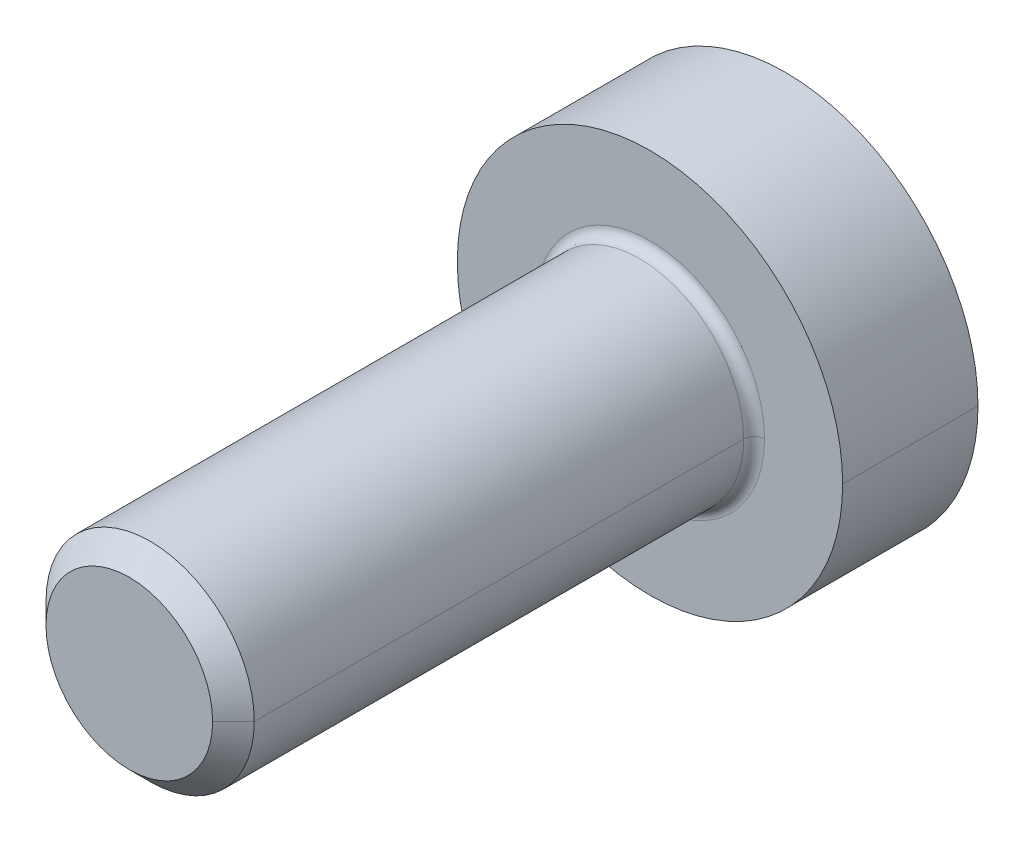
ISO-10303-21;
HEADER;
FILE_DESCRIPTION(('STEP AP214'),'2;1');
FILE_NAME('part.step','',(''),(''),'','','');
FILE_SCHEMA(('AUTOMOTIVE_DESIGN { 1 0 10303 214 1 1 1 1 }'));
ENDSEC;
DATA;
#1=APPLICATION_CONTEXT('core data for automotive mechanical design processes');
#2=APPLICATION_PROTOCOL_DEFINITION('international standard','automotive_design',2000,#1);
#3=PRODUCT_CONTEXT('',#1,'mechanical');
#4=PRODUCT('Part','Part','',(#3));
#5=PRODUCT_RELATED_PRODUCT_CATEGORY('part','',(#4));
#6=PRODUCT_DEFINITION_FORMATION('','',#4);
#7=PRODUCT_DEFINITION_CONTEXT('part definition',#1,'design');
#8=PRODUCT_DEFINITION('design','',#6,#7);
#9=PRODUCT_DEFINITION_SHAPE('','',#8);
#10=(LENGTH_UNIT() NAMED_UNIT(*) SI_UNIT(.MILLI.,.METRE.));
#11=(NAMED_UNIT(*) PLANE_ANGLE_UNIT() SI_UNIT($,.RADIAN.));
#12=(NAMED_UNIT(*) SI_UNIT($,.STERADIAN.) SOLID_ANGLE_UNIT());
#13=UNCERTAINTY_MEASURE_WITH_UNIT(LENGTH_MEASURE(1.E-05),#10,'distance_accuracy_value','');
#14=(GEOMETRIC_REPRESENTATION_CONTEXT(3) GLOBAL_UNCERTAINTY_ASSIGNED_CONTEXT((#13)) GLOBAL_UNIT_ASSIGNED_CONTEXT((#10,
#11,#12)) REPRESENTATION_CONTEXT('',''));
#15=CARTESIAN_POINT('',(0.,0.,0.));
#16=DIRECTION('',(0.,0.,1.));
#17=DIRECTION('',(1.,0.,0.));
#18=AXIS2_PLACEMENT_3D('',#15,#16,#17);
#19=CARTESIAN_POINT('',(0.,0.,6.3));
#20=DIRECTION('',(0.,0.,1.));
#21=DIRECTION('',(1.,0.,0.));
#22=AXIS2_PLACEMENT_3D('',#19,#20,#21);
#23=CYLINDRICAL_SURFACE('',#22,0.8);
#24=CARTESIAN_POINT('',(0.8,0.,1.3));
#25=DIRECTION('',(0.,0.,1.));
#26=VECTOR('',#25,1.);
#27=LINE('',#24,#26);
#28=CARTESIAN_POINT('',(0.8,0.,1.3));
#29=VERTEX_POINT('',#28);
#30=CARTESIAN_POINT('',(0.8,0.,6.3));
#31=VERTEX_POINT('',#30);
#32=EDGE_CURVE('P0_E27',#29,#31,#27,.T.);
#33=ORIENTED_EDGE('',*,*,#32,.T.);
#34=CARTESIAN_POINT('',(0.,0.,6.3));
#35=DIRECTION('',(0.,0.,-1.));
#36=DIRECTION('',(1.,0.,0.));
#37=AXIS2_PLACEMENT_3D('',#34,#35,#36);
#38=CIRCLE('',#37,0.8);
#39=CARTESIAN_POINT('',(-0.8,0.,6.3));
#40=VERTEX_POINT('',#39);
#41=EDGE_CURVE('P0_E11',#31,#40,#38,.T.);
#42=ORIENTED_EDGE('',*,*,#41,.T.);
#43=CARTESIAN_POINT('',(-0.8,0.,6.3));
#44=DIRECTION('',(0.,0.,-1.));
#45=VECTOR('',#44,1.);
#46=LINE('',#43,#45);
#47=CARTESIAN_POINT('',(-0.8,0.,1.3));
#48=VERTEX_POINT('',#47);
#49=EDGE_CURVE('P0_E94',#40,#48,#46,.T.);
#50=ORIENTED_EDGE('',*,*,#49,.T.);
#51=CARTESIAN_POINT('',(0.,0.,1.3));
#52=DIRECTION('',(0.,0.,1.));
#53=DIRECTION('',(-1.,0.,0.));
#54=AXIS2_PLACEMENT_3D('',#51,#52,#53);
#55=CIRCLE('',#54,0.8);
#56=EDGE_CURVE('P0_E73',#48,#29,#55,.T.);
#57=ORIENTED_EDGE('',*,*,#56,.T.);
#58=EDGE_LOOP('',(#33,#42,#50,#57));
#59=FACE_BOUND('',#58,.T.);
#60=ADVANCED_FACE('P0_F16',(#59),#23,.T.);
#61=CARTESIAN_POINT('',(0.,0.,6.3));
#62=DIRECTION('',(0.,0.,1.));
#63=DIRECTION('',(1.,0.,0.));
#64=AXIS2_PLACEMENT_3D('',#61,#62,#63);
#65=CYLINDRICAL_SURFACE('',#64,0.8);
#66=ORIENTED_EDGE('',*,*,#49,.F.);
#67=CARTESIAN_POINT('',(0.,0.,6.3));
#68=DIRECTION('',(0.,0.,-1.));
#69=DIRECTION('',(-1.,0.,0.));
#70=AXIS2_PLACEMENT_3D('',#67,#68,#69);
#71=CIRCLE('',#70,0.8);
#72=EDGE_CURVE('P0_E35',#40,#31,#71,.T.);
#73=ORIENTED_EDGE('',*,*,#72,.T.);
#74=ORIENTED_EDGE('',*,*,#32,.F.);
#75=CARTESIAN_POINT('',(0.,0.,1.3));
#76=DIRECTION('',(0.,0.,1.));
#77=DIRECTION('',(1.,0.,0.));
#78=AXIS2_PLACEMENT_3D('',#75,#76,#77);
#79=CIRCLE('',#78,0.8);
#80=EDGE_CURVE('P0_E56',#29,#48,#79,.T.);
#81=ORIENTED_EDGE('',*,*,#80,.T.);
#82=EDGE_LOOP('',(#66,#73,#74,#81));
#83=FACE_BOUND('',#82,.T.);
#84=ADVANCED_FACE('P0_F86',(#83),#65,.T.);
#85=CARTESIAN_POINT('',(0.,0.,1.3));
#86=DIRECTION('',(0.,0.,1.));
#87=DIRECTION('',(1.,0.,0.));
#88=AXIS2_PLACEMENT_3D('',#85,#86,#87);
#89=PLANE('',#88);
#90=ORIENTED_EDGE('',*,*,#56,.F.);
#91=ORIENTED_EDGE('',*,*,#80,.F.);
#92=EDGE_LOOP('',(#90,#91));
#93=FACE_BOUND('',#92,.T.);
#94=CARTESIAN_POINT('',(-1.,0.,1.3));
#95=CARTESIAN_POINT('',(-0.996554083441114,-0.209703851577792,1.3));
#96=CARTESIAN_POINT('',(-0.922226760783708,-0.386631412951767,1.3));
#97=CARTESIAN_POINT('',(-0.845262108690317,-0.569836830825425,1.3));
#98=CARTESIAN_POINT('',(-0.702627907972833,-0.711532071929233,1.3));
#99=CARTESIAN_POINT('',(-0.562888071399035,-0.850352002461534,1.3));
#100=CARTESIAN_POINT('',(-0.378430108277403,-0.92560272814395,1.3));
#101=CARTESIAN_POINT('',(-0.194337694161928,-1.00070432593012,1.3));
#102=CARTESIAN_POINT('',(0.00390955983632408,-0.999965197467083,1.3));
#103=CARTESIAN_POINT('',(0.201416048891478,-0.999228830810036,1.3));
#104=CARTESIAN_POINT('',(0.385937188211464,-0.92250020220585,1.3));
#105=CARTESIAN_POINT('',(0.567592859321982,-0.846963108874163,1.3));
#106=CARTESIAN_POINT('',(0.706969694859683,-0.707222004365567,1.3));
#107=CARTESIAN_POINT('',(0.846929856822322,-0.566896048876567,1.3));
#108=CARTESIAN_POINT('',(0.923036338619758,-0.384696891490225,1.3));
#109=CARTESIAN_POINT('',(0.996267348491069,-0.209381622961374,1.3));
#110=CARTESIAN_POINT('',(1.,0.,1.3));
#111=B_SPLINE_CURVE_WITH_KNOTS('',2,(#94,#95,#96,#97,#98,#99,#100,#101,#102,#103,#104,#105,#106,
#107,#108,#109,#110),.UNSPECIFIED.,.F.,.F.,(3,2,2,2,2,2,2,2,3),(0.,0.125,0.25,0.375,0.5,0.625,
0.75,0.875,1.),.UNSPECIFIED.);
#112=CARTESIAN_POINT('',(-1.,0.,1.3));
#113=VERTEX_POINT('',#112);
#114=CARTESIAN_POINT('',(1.,0.,1.3));
#115=VERTEX_POINT('',#114);
#116=EDGE_CURVE('P0_E49',#113,#115,#111,.T.);
#117=ORIENTED_EDGE('',*,*,#116,.T.);
#118=CARTESIAN_POINT('',(1.,0.,1.3));
#119=CARTESIAN_POINT('',(0.996554083441114,0.209703851577792,1.3));
#120=CARTESIAN_POINT('',(0.922226760783708,0.386631412951767,1.3));
#121=CARTESIAN_POINT('',(0.845262108690317,0.569836830825425,1.3));
#122=CARTESIAN_POINT('',(0.702627907972833,0.711532071929233,1.3));
#123=CARTESIAN_POINT('',(0.562888071399035,0.850352002461534,1.3));
#124=CARTESIAN_POINT('',(0.378430108277403,0.92560272814395,1.3));
#125=CARTESIAN_POINT('',(0.194337694161928,1.00070432593012,1.3));
#126=CARTESIAN_POINT('',(-0.00390955983632408,0.999965197467083,1.3));
#127=CARTESIAN_POINT('',(-0.201416048891478,0.999228830810036,1.3));
#128=CARTESIAN_POINT('',(-0.385937188211464,0.92250020220585,1.3));
#129=CARTESIAN_POINT('',(-0.567592859321982,0.846963108874163,1.3));
#130=CARTESIAN_POINT('',(-0.706969694859683,0.707222004365567,1.3));
#131=CARTESIAN_POINT('',(-0.846929856822322,0.566896048876567,1.3));
#132=CARTESIAN_POINT('',(-0.923036338619758,0.384696891490225,1.3));
#133=CARTESIAN_POINT('',(-0.996267348491069,0.209381622961374,1.3));
#134=CARTESIAN_POINT('',(-1.,0.,1.3));
#135=B_SPLINE_CURVE_WITH_KNOTS('',2,(#118,#119,#120,#121,#122,#123,#124,#125,#126,#127,#128,
#129,#130,#131,#132,#133,#134),.UNSPECIFIED.,.F.,.F.,(3,2,2,2,2,2,2,2,3),(0.,0.125,0.25,0.375,
0.5,0.625,0.75,0.875,1.),.UNSPECIFIED.);
#136=EDGE_CURVE('P0_E53',#115,#113,#135,.T.);
#137=ORIENTED_EDGE('',*,*,#136,.T.);
#138=EDGE_LOOP('',(#117,#137));
#139=FACE_BOUND('',#138,.T.);
#140=ADVANCED_FACE('P0_F17',(#93,#139),#89,.T.);
#141=OPEN_SHELL('',(#60,#84,#140));
#142=SHELL_BASED_SURFACE_MODEL('P0_B1',(#141));
#143=CARTESIAN_POINT('',(0.,0.,6.3));
#144=DIRECTION('',(0.,0.,1.));
#145=DIRECTION('',(1.,0.,0.));
#146=AXIS2_PLACEMENT_3D('',#143,#144,#145);
#147=PLANE('',#146);
#148=CARTESIAN_POINT('',(0.,0.,6.3));
#149=DIRECTION('',(0.,0.,-1.));
#150=DIRECTION('',(0.,-1.,0.));
#151=AXIS2_PLACEMENT_3D('',#148,#149,#150);
#152=CIRCLE('',#151,0.8000000000001);
#153=CARTESIAN_POINT('',(0.,-0.8000000000001,6.3));
#154=VERTEX_POINT('',#153);
#155=CARTESIAN_POINT('',(-0.8000000000001,0.,6.3));
#156=VERTEX_POINT('',#155);
#157=EDGE_CURVE('P1_E11',#154,#156,#152,.T.);
#158=ORIENTED_EDGE('',*,*,#157,.F.);
#159=CARTESIAN_POINT('',(0.,0.,6.3));
#160=DIRECTION('',(0.,0.,-1.));
#161=DIRECTION('',(1.,0.,0.));
#162=AXIS2_PLACEMENT_3D('',#159,#160,#161);
#163=CIRCLE('',#162,0.8000000000001);
#164=CARTESIAN_POINT('',(0.8000000000001,-1.782773509101E-08,6.3));
#165=VERTEX_POINT('',#164);
#166=EDGE_CURVE('P1_E27',#165,#154,#163,.T.);
#167=ORIENTED_EDGE('',*,*,#166,.F.);
#168=CARTESIAN_POINT('',(0.,0.,6.3));
#169=DIRECTION('',(0.,0.,-1.));
#170=DIRECTION('',(0.,1.,0.));
#171=AXIS2_PLACEMENT_3D('',#168,#169,#170);
#172=CIRCLE('',#171,0.8000000000001);
#173=CARTESIAN_POINT('',(0.,0.8000000000001,6.3));
#174=VERTEX_POINT('',#173);
#175=EDGE_CURVE('P1_E159',#174,#165,#172,.T.);
#176=ORIENTED_EDGE('',*,*,#175,.F.);
#177=CARTESIAN_POINT('',(0.,0.,6.3));
#178=DIRECTION('',(0.,0.,-1.));
#179=DIRECTION('',(-1.,0.,0.));
#180=AXIS2_PLACEMENT_3D('',#177,#178,#179);
#181=CIRCLE('',#180,0.8000000000001);
#182=EDGE_CURVE('P1_E218',#156,#174,#181,.T.);
#183=ORIENTED_EDGE('',*,*,#182,.F.);
#184=EDGE_LOOP('',(#158,#167,#176,#183));
#185=FACE_BOUND('',#184,.T.);
#186=ADVANCED_FACE('P1_F16',(#185),#147,.T.);
#187=CARTESIAN_POINT('',(0.,0.,6.2));
#188=DIRECTION('',(0.,0.,-1.));
#189=DIRECTION('',(0.,-1.,0.));
#190=AXIS2_PLACEMENT_3D('',#187,#188,#189);
#191=CONICAL_SURFACE('',#190,0.9000000000001,0.7853981633973);
#192=DIRECTION('',(0.707106781186498,-2.22582120003299E-08,-0.707106781186597));
#193=VECTOR('',#192,1.);
#194=CARTESIAN_POINT('',(0.8000000000001,-1.782773509101E-08,6.3));
#195=LINE('',#194,#193);
#196=CARTESIAN_POINT('',(1.,-1.481961296978E-08,6.1));
#197=VERTEX_POINT('',#196);
#198=EDGE_CURVE('P1_E151',#165,#197,#195,.T.);
#199=ORIENTED_EDGE('',*,*,#198,.F.);
#200=ORIENTED_EDGE('',*,*,#166,.T.);
#201=ORIENTED_EDGE('',*,*,#157,.T.);
#202=DIRECTION('',(-0.707106781186498,-3.93941033222099E-09,-0.707106781186598));
#203=VECTOR('',#202,1.);
#204=CARTESIAN_POINT('',(-0.8000000000001,1.782773532786E-08,6.3));
#205=LINE('',#204,#203);
#206=CARTESIAN_POINT('',(-1.,1.671350182394E-08,6.1));
#207=VERTEX_POINT('',#206);
#208=EDGE_CURVE('P1_E172',#156,#207,#205,.T.);
#209=ORIENTED_EDGE('',*,*,#208,.T.);
#210=CARTESIAN_POINT('',(0.,0.,6.1));
#211=DIRECTION('',(0.,0.,-1.));
#212=DIRECTION('',(0.,-1.,0.));
#213=AXIS2_PLACEMENT_3D('',#210,#211,#212);
#214=CIRCLE('',#213,1.);
#215=CARTESIAN_POINT('',(0.,-1.,6.1));
#216=VERTEX_POINT('',#215);
#217=EDGE_CURVE('P1_E177',#216,#207,#214,.T.);
#218=ORIENTED_EDGE('',*,*,#217,.F.);
#219=CARTESIAN_POINT('',(0.,0.,6.1));
#220=DIRECTION('',(0.,0.,-1.));
#221=DIRECTION('',(1.,-1.481961296978E-08,0.));
#222=AXIS2_PLACEMENT_3D('',#219,#220,#221);
#223=CIRCLE('',#222,1.);
#224=EDGE_CURVE('P1_E175',#197,#216,#223,.T.);
#225=ORIENTED_EDGE('',*,*,#224,.F.);
#226=EDGE_LOOP('',(#199,#200,#201,#209,#218,#225));
#227=FACE_BOUND('',#226,.T.);
#228=ADVANCED_FACE('P1_F18',(#227),#191,.T.);
#229=CARTESIAN_POINT('',(0.,0.,6.2));
#230=DIRECTION('',(0.,0.,-1.));
#231=DIRECTION('',(0.,-1.,0.));
#232=AXIS2_PLACEMENT_3D('',#229,#230,#231);
#233=CONICAL_SURFACE('',#232,0.9000000000001,0.7853981633973);
#234=ORIENTED_EDGE('',*,*,#208,.F.);
#235=ORIENTED_EDGE('',*,*,#182,.T.);
#236=ORIENTED_EDGE('',*,*,#175,.T.);
#237=ORIENTED_EDGE('',*,*,#198,.T.);
#238=CARTESIAN_POINT('',(0.,0.,6.1));
#239=DIRECTION('',(0.,0.,-1.));
#240=DIRECTION('',(0.,1.,0.));
#241=AXIS2_PLACEMENT_3D('',#238,#239,#240);
#242=CIRCLE('',#241,1.);
#243=CARTESIAN_POINT('',(0.,1.,6.1));
#244=VERTEX_POINT('',#243);
#245=EDGE_CURVE('P1_E156',#244,#197,#242,.T.);
#246=ORIENTED_EDGE('',*,*,#245,.F.);
#247=CARTESIAN_POINT('',(0.,0.,6.1));
#248=DIRECTION('',(0.,0.,-1.));
#249=DIRECTION('',(-1.,0.,0.));
#250=AXIS2_PLACEMENT_3D('',#247,#248,#249);
#251=CIRCLE('',#250,1.);
#252=EDGE_CURVE('P1_E170',#207,#244,#251,.T.);
#253=ORIENTED_EDGE('',*,*,#252,.F.);
#254=EDGE_LOOP('',(#234,#235,#236,#237,#246,#253));
#255=FACE_BOUND('',#254,.T.);
#256=ADVANCED_FACE('P1_F154',(#255),#233,.T.);
#257=CARTESIAN_POINT('',(0.,0.,15.5));
#258=DIRECTION('',(0.,0.,-1.));
#259=DIRECTION('',(-1.,0.,0.));
#260=AXIS2_PLACEMENT_3D('',#257,#258,#259);
#261=CYLINDRICAL_SURFACE('',#260,1.);
#262=DIRECTION('',(0.,3.54836305446E-09,1.));
#263=VECTOR('',#262,1.);
#264=CARTESIAN_POINT('',(-1.,3.619546798041E-11,1.4));
#265=LINE('',#264,#263);
#266=CARTESIAN_POINT('',(-1.,0.,1.4));
#267=VERTEX_POINT('',#266);
#268=EDGE_CURVE('P1_E240',#267,#207,#265,.T.);
#269=ORIENTED_EDGE('',*,*,#268,.T.);
#270=ORIENTED_EDGE('',*,*,#252,.T.);
#271=ORIENTED_EDGE('',*,*,#245,.T.);
#272=DIRECTION('',(0.,3.548363007216E-09,-1.));
#273=VECTOR('',#272,1.);
#274=CARTESIAN_POINT('',(1.,-2.412330814802E-08,6.1));
#275=LINE('',#274,#273);
#276=CARTESIAN_POINT('',(1.,-1.481961296734E-08,1.4));
#277=VERTEX_POINT('',#276);
#278=EDGE_CURVE('P1_E169',#197,#277,#275,.T.);
#279=ORIENTED_EDGE('',*,*,#278,.T.);
#280=CARTESIAN_POINT('',(0.,0.,1.4));
#281=DIRECTION('',(0.,0.,1.));
#282=DIRECTION('',(1.,-1.481961296978E-08,0.));
#283=AXIS2_PLACEMENT_3D('',#280,#281,#282);
#284=CIRCLE('',#283,1.);
#285=CARTESIAN_POINT('',(-0.9940416406652,0.1090009936818,1.4));
#286=VERTEX_POINT('',#285);
#287=EDGE_CURVE('P1_E236',#277,#286,#284,.T.);
#288=ORIENTED_EDGE('',*,*,#287,.T.);
#289=CARTESIAN_POINT('',(0.,0.,1.4));
#290=DIRECTION('',(0.,0.,1.));
#291=DIRECTION('',(-0.994041640665209,0.109000993681801,0.));
#292=AXIS2_PLACEMENT_3D('',#289,#290,#291);
#293=CIRCLE('',#292,1.);
#294=EDGE_CURVE('P1_E239',#286,#267,#293,.T.);
#295=ORIENTED_EDGE('',*,*,#294,.T.);
#296=EDGE_LOOP('',(#269,#270,#271,#279,#288,#295));
#297=FACE_BOUND('',#296,.T.);
#298=ADVANCED_FACE('P1_F167',(#297),#261,.T.);
#299=CARTESIAN_POINT('',(0.,0.,1.4));
#300=DIRECTION('',(0.,0.,-1.));
#301=DIRECTION('',(0.994041640665209,-0.109000993681801,0.));
#302=AXIS2_PLACEMENT_3D('',#299,#300,#301);
#303=TOROIDAL_SURFACE('',#302,1.1,0.1);
#304=CARTESIAN_POINT('',(-1.1,7.963049664106E-11,1.4));
#305=DIRECTION('',(7.239134292014E-11,1.,0.));
#306=DIRECTION('',(1.,-7.239134292014E-11,0.));
#307=AXIS2_PLACEMENT_3D('',#304,#305,#306);
#308=CIRCLE('',#307,0.1);
#309=CARTESIAN_POINT('',(-1.1,0.,1.3));
#310=VERTEX_POINT('',#309);
#311=EDGE_CURVE('P1_E261',#267,#310,#308,.T.);
#312=ORIENTED_EDGE('',*,*,#311,.F.);
#313=ORIENTED_EDGE('',*,*,#294,.F.);
#314=ORIENTED_EDGE('',*,*,#287,.F.);
#315=CARTESIAN_POINT('',(1.1,-7.963049664106E-11,1.4));
#316=DIRECTION('',(-7.239134292014E-11,-1.,0.));
#317=DIRECTION('',(-1.,7.239134292014E-11,0.));
#318=AXIS2_PLACEMENT_3D('',#315,#316,#317);
#319=CIRCLE('',#318,0.1);
#320=CARTESIAN_POINT('',(1.1,0.,1.3));
#321=VERTEX_POINT('',#320);
#322=EDGE_CURVE('P1_E194',#277,#321,#319,.T.);
#323=ORIENTED_EDGE('',*,*,#322,.T.);
#324=CARTESIAN_POINT('',(0.,0.,1.3));
#325=DIRECTION('',(0.,0.,1.));
#326=DIRECTION('',(1.,0.,0.));
#327=AXIS2_PLACEMENT_3D('',#324,#325,#326);
#328=CIRCLE('',#327,1.1);
#329=EDGE_CURVE('P1_E244',#321,#310,#328,.T.);
#330=ORIENTED_EDGE('',*,*,#329,.T.);
#331=EDGE_LOOP('',(#312,#313,#314,#323,#330));
#332=FACE_BOUND('',#331,.T.);
#333=ADVANCED_FACE('P1_F365',(#332),#303,.F.);
#334=CARTESIAN_POINT('',(0.,0.,0.8));
#335=DIRECTION('',(0.,0.,-1.));
#336=DIRECTION('',(0.,-1.,0.));
#337=AXIS2_PLACEMENT_3D('',#334,#335,#336);
#338=PLANE('',#337);
#339=DIRECTION('',(0.,1.,0.));
#340=VECTOR('',#339,1.);
#341=CARTESIAN_POINT('',(0.75,-0.4330127018922,0.8));
#342=LINE('',#341,#340);
#343=CARTESIAN_POINT('',(0.75,-0.4330127018922,0.8));
#344=VERTEX_POINT('',#343);
#345=CARTESIAN_POINT('',(0.75,0.4330127018922,0.8));
#346=VERTEX_POINT('',#345);
#347=EDGE_CURVE('P1_E250',#344,#346,#342,.T.);
#348=ORIENTED_EDGE('',*,*,#347,.F.);
#349=DIRECTION('',(0.866025403784429,0.500000000000017,0.));
#350=VECTOR('',#349,1.);
#351=CARTESIAN_POINT('',(0.,-0.8660254037844,0.8));
#352=LINE('',#351,#350);
#353=CARTESIAN_POINT('',(0.,-0.8660254037844,0.8));
#354=VERTEX_POINT('',#353);
#355=EDGE_CURVE('P1_E228',#354,#344,#352,.T.);
#356=ORIENTED_EDGE('',*,*,#355,.F.);
#357=DIRECTION('',(0.866025403784429,-0.500000000000017,0.));
#358=VECTOR('',#357,1.);
#359=CARTESIAN_POINT('',(-0.75,-0.4330127018922,0.8));
#360=LINE('',#359,#358);
#361=CARTESIAN_POINT('',(-0.75,-0.4330127018922,0.8));
#362=VERTEX_POINT('',#361);
#363=EDGE_CURVE('P1_E229',#362,#354,#360,.T.);
#364=ORIENTED_EDGE('',*,*,#363,.F.);
#365=DIRECTION('',(0.,-1.,0.));
#366=VECTOR('',#365,1.);
#367=CARTESIAN_POINT('',(-0.75,0.4330127018922,0.8));
#368=LINE('',#367,#366);
#369=CARTESIAN_POINT('',(-0.75,0.4330127018922,0.8));
#370=VERTEX_POINT('',#369);
#371=EDGE_CURVE('P1_E207',#370,#362,#368,.T.);
#372=ORIENTED_EDGE('',*,*,#371,.F.);
#373=DIRECTION('',(-0.866025403784429,-0.500000000000017,0.));
#374=VECTOR('',#373,1.);
#375=CARTESIAN_POINT('',(0.,0.8660254037844,0.8));
#376=LINE('',#375,#374);
#377=CARTESIAN_POINT('',(0.,0.8660254037844,0.8));
#378=VERTEX_POINT('',#377);
#379=EDGE_CURVE('P1_E20',#378,#370,#376,.T.);
#380=ORIENTED_EDGE('',*,*,#379,.F.);
#381=DIRECTION('',(-0.866025403784429,0.500000000000017,0.));
#382=VECTOR('',#381,1.);
#383=CARTESIAN_POINT('',(0.75,0.4330127018922,0.8));
#384=LINE('',#383,#382);
#385=EDGE_CURVE('P1_E223',#346,#378,#384,.T.);
#386=ORIENTED_EDGE('',*,*,#385,.F.);
#387=EDGE_LOOP('',(#348,#356,#364,#372,#380,#386));
#388=FACE_BOUND('',#387,.T.);
#389=ADVANCED_FACE('P1_F368',(#388),#338,.T.);
#390=CARTESIAN_POINT('',(0.75,0.4330127018922,0.));
#391=DIRECTION('',(1.,0.,0.));
#392=DIRECTION('',(0.,1.,0.));
#393=AXIS2_PLACEMENT_3D('',#390,#391,#392);
#394=PLANE('',#393);
#395=DIRECTION('',(0.,0.,-1.));
#396=VECTOR('',#395,1.);
#397=CARTESIAN_POINT('',(0.75,-0.4330127018922,0.8));
#398=LINE('',#397,#396);
#399=CARTESIAN_POINT('',(0.75,-0.4330127018922,0.));
#400=VERTEX_POINT('',#399);
#401=EDGE_CURVE('P1_E251',#344,#400,#398,.T.);
#402=ORIENTED_EDGE('',*,*,#401,.F.);
#403=ORIENTED_EDGE('',*,*,#347,.T.);
#404=DIRECTION('',(0.,0.,-1.));
#405=VECTOR('',#404,1.);
#406=CARTESIAN_POINT('',(0.75,0.4330127018922,0.8));
#407=LINE('',#406,#405);
#408=CARTESIAN_POINT('',(0.75,0.4330127018922,0.));
#409=VERTEX_POINT('',#408);
#410=EDGE_CURVE('P1_E220',#346,#409,#407,.T.);
#411=ORIENTED_EDGE('',*,*,#410,.T.);
#412=DIRECTION('',(0.,1.,0.));
#413=VECTOR('',#412,1.);
#414=CARTESIAN_POINT('',(0.75,-0.4330127018922,0.));
#415=LINE('',#414,#413);
#416=EDGE_CURVE('P1_E235',#400,#409,#415,.T.);
#417=ORIENTED_EDGE('',*,*,#416,.F.);
#418=EDGE_LOOP('',(#402,#403,#411,#417));
#419=FACE_BOUND('',#418,.T.);
#420=ADVANCED_FACE('P1_F384',(#419),#394,.F.);
#421=CARTESIAN_POINT('',(0.75,-0.4330127018922,0.));
#422=DIRECTION('',(0.500000000000017,-0.866025403784429,0.));
#423=DIRECTION('',(0.,0.,-1.));
#424=AXIS2_PLACEMENT_3D('',#421,#422,#423);
#425=PLANE('',#424);
#426=DIRECTION('',(0.,0.,-1.));
#427=VECTOR('',#426,1.);
#428=CARTESIAN_POINT('',(0.,-0.8660254037844,0.8));
#429=LINE('',#428,#427);
#430=CARTESIAN_POINT('',(0.,-0.8660254037844,0.));
#431=VERTEX_POINT('',#430);
#432=EDGE_CURVE('P1_E225',#354,#431,#429,.T.);
#433=ORIENTED_EDGE('',*,*,#432,.F.);
#434=ORIENTED_EDGE('',*,*,#355,.T.);
#435=ORIENTED_EDGE('',*,*,#401,.T.);
#436=DIRECTION('',(-0.866025403784429,-0.500000000000017,0.));
#437=VECTOR('',#436,1.);
#438=CARTESIAN_POINT('',(0.75,-0.4330127018922,0.));
#439=LINE('',#438,#437);
#440=EDGE_CURVE('P1_E269',#400,#431,#439,.T.);
#441=ORIENTED_EDGE('',*,*,#440,.T.);
#442=EDGE_LOOP('',(#433,#434,#435,#441));
#443=FACE_BOUND('',#442,.T.);
#444=ADVANCED_FACE('P1_F363',(#443),#425,.F.);
#445=CARTESIAN_POINT('',(0.,-0.8660254037844,0.));
#446=DIRECTION('',(-0.500000000000017,-0.866025403784429,0.));
#447=DIRECTION('',(-0.866025403784429,0.500000000000017,0.));
#448=AXIS2_PLACEMENT_3D('',#445,#446,#447);
#449=PLANE('',#448);
#450=DIRECTION('',(0.,0.,-1.));
#451=VECTOR('',#450,1.);
#452=CARTESIAN_POINT('',(-0.75,-0.4330127018922,0.8));
#453=LINE('',#452,#451);
#454=CARTESIAN_POINT('',(-0.75,-0.4330127018922,0.));
#455=VERTEX_POINT('',#454);
#456=EDGE_CURVE('P1_E211',#362,#455,#453,.T.);
#457=ORIENTED_EDGE('',*,*,#456,.F.);
#458=ORIENTED_EDGE('',*,*,#363,.T.);
#459=ORIENTED_EDGE('',*,*,#432,.T.);
#460=DIRECTION('',(-0.866025403784429,0.500000000000017,0.));
#461=VECTOR('',#460,1.);
#462=CARTESIAN_POINT('',(0.,-0.8660254037844,0.));
#463=LINE('',#462,#461);
#464=EDGE_CURVE('P1_E205',#431,#455,#463,.T.);
#465=ORIENTED_EDGE('',*,*,#464,.T.);
#466=EDGE_LOOP('',(#457,#458,#459,#465));
#467=FACE_BOUND('',#466,.T.);
#468=ADVANCED_FACE('P1_F352',(#467),#449,.F.);
#469=CARTESIAN_POINT('',(-0.75,-0.4330127018922,0.));
#470=DIRECTION('',(-1.,0.,0.));
#471=DIRECTION('',(0.,0.,1.));
#472=AXIS2_PLACEMENT_3D('',#469,#470,#471);
#473=PLANE('',#472);
#474=DIRECTION('',(0.,0.,-1.));
#475=VECTOR('',#474,1.);
#476=CARTESIAN_POINT('',(-0.75,0.4330127018922,0.8));
#477=LINE('',#476,#475);
#478=CARTESIAN_POINT('',(-0.75,0.4330127018922,0.));
#479=VERTEX_POINT('',#478);
#480=EDGE_CURVE('P1_E212',#370,#479,#477,.T.);
#481=ORIENTED_EDGE('',*,*,#480,.F.);
#482=ORIENTED_EDGE('',*,*,#371,.T.);
#483=ORIENTED_EDGE('',*,*,#456,.T.);
#484=DIRECTION('',(0.,-1.,0.));
#485=VECTOR('',#484,1.);
#486=CARTESIAN_POINT('',(-0.75,0.4330127018922,0.));
#487=LINE('',#486,#485);
#488=EDGE_CURVE('P1_E201',#479,#455,#487,.T.);
#489=ORIENTED_EDGE('',*,*,#488,.F.);
#490=EDGE_LOOP('',(#481,#482,#483,#489));
#491=FACE_BOUND('',#490,.T.);
#492=ADVANCED_FACE('P1_F344',(#491),#473,.F.);
#493=CARTESIAN_POINT('',(-0.75,0.4330127018922,0.));
#494=DIRECTION('',(-0.500000000000017,0.866025403784429,0.));
#495=DIRECTION('',(0.,0.,1.));
#496=AXIS2_PLACEMENT_3D('',#493,#494,#495);
#497=PLANE('',#496);
#498=DIRECTION('',(0.,0.,-1.));
#499=VECTOR('',#498,1.);
#500=CARTESIAN_POINT('',(0.,0.8660254037844,0.8));
#501=LINE('',#500,#499);
#502=CARTESIAN_POINT('',(0.,0.8660254037844,0.));
#503=VERTEX_POINT('',#502);
#504=EDGE_CURVE('P1_E272',#378,#503,#501,.T.);
#505=ORIENTED_EDGE('',*,*,#504,.F.);
#506=ORIENTED_EDGE('',*,*,#379,.T.);
#507=ORIENTED_EDGE('',*,*,#480,.T.);
#508=DIRECTION('',(0.866025403784429,0.500000000000017,0.));
#509=VECTOR('',#508,1.);
#510=CARTESIAN_POINT('',(-0.75,0.4330127018922,0.));
#511=LINE('',#510,#509);
#512=EDGE_CURVE('P1_E206',#479,#503,#511,.T.);
#513=ORIENTED_EDGE('',*,*,#512,.T.);
#514=EDGE_LOOP('',(#505,#506,#507,#513));
#515=FACE_BOUND('',#514,.T.);
#516=ADVANCED_FACE('P1_F342',(#515),#497,.F.);
#517=CARTESIAN_POINT('',(0.,0.8660254037844,0.));
#518=DIRECTION('',(0.500000000000017,0.866025403784429,0.));
#519=DIRECTION('',(0.,0.,-1.));
#520=AXIS2_PLACEMENT_3D('',#517,#518,#519);
#521=PLANE('',#520);
#522=ORIENTED_EDGE('',*,*,#410,.F.);
#523=ORIENTED_EDGE('',*,*,#385,.T.);
#524=ORIENTED_EDGE('',*,*,#504,.T.);
#525=DIRECTION('',(0.866025403784429,-0.500000000000017,0.));
#526=VECTOR('',#525,1.);
#527=CARTESIAN_POINT('',(0.,0.8660254037844,0.));
#528=LINE('',#527,#526);
#529=EDGE_CURVE('P1_E224',#503,#409,#528,.T.);
#530=ORIENTED_EDGE('',*,*,#529,.T.);
#531=EDGE_LOOP('',(#522,#523,#524,#530));
#532=FACE_BOUND('',#531,.T.);
#533=ADVANCED_FACE('P1_F333',(#532),#521,.F.);
#534=CARTESIAN_POINT('',(0.,0.,0.));
#535=DIRECTION('',(0.,0.,1.));
#536=DIRECTION('',(1.,0.,0.));
#537=AXIS2_PLACEMENT_3D('',#534,#535,#536);
#538=PLANE('',#537);
#539=ORIENTED_EDGE('',*,*,#512,.F.);
#540=ORIENTED_EDGE('',*,*,#488,.T.);
#541=ORIENTED_EDGE('',*,*,#464,.F.);
#542=ORIENTED_EDGE('',*,*,#440,.F.);
#543=ORIENTED_EDGE('',*,*,#416,.T.);
#544=ORIENTED_EDGE('',*,*,#529,.F.);
#545=EDGE_LOOP('',(#539,#540,#541,#542,#543,#544));
#546=FACE_BOUND('',#545,.T.);
#547=CARTESIAN_POINT('',(0.,0.,0.));
#548=DIRECTION('',(0.,0.,1.));
#549=DIRECTION('',(-1.,0.,0.));
#550=AXIS2_PLACEMENT_3D('',#547,#548,#549);
#551=CIRCLE('',#550,1.85);
#552=CARTESIAN_POINT('',(-1.85,0.,0.));
#553=VERTEX_POINT('',#552);
#554=CARTESIAN_POINT('',(1.85,0.,0.));
#555=VERTEX_POINT('',#554);
#556=EDGE_CURVE('P1_E216',#553,#555,#551,.T.);
#557=ORIENTED_EDGE('',*,*,#556,.F.);
#558=CARTESIAN_POINT('',(0.,0.,0.));
#559=DIRECTION('',(0.,0.,1.));
#560=DIRECTION('',(1.,0.,0.));
#561=AXIS2_PLACEMENT_3D('',#558,#559,#560);
#562=CIRCLE('',#561,1.85);
#563=EDGE_CURVE('P1_E196',#555,#553,#562,.T.);
#564=ORIENTED_EDGE('',*,*,#563,.F.);
#565=EDGE_LOOP('',(#557,#564));
#566=FACE_BOUND('',#565,.T.);
#567=ADVANCED_FACE('P1_F338',(#546,#566),#538,.F.);
#568=CARTESIAN_POINT('',(0.,0.,1.5));
#569=DIRECTION('',(0.,0.,1.));
#570=DIRECTION('',(1.,0.,0.));
#571=AXIS2_PLACEMENT_3D('',#568,#569,#570);
#572=CYLINDRICAL_SURFACE('',#571,1.85);
#573=DIRECTION('',(0.,0.,1.));
#574=VECTOR('',#573,1.);
#575=CARTESIAN_POINT('',(-1.85,0.,0.));
#576=LINE('',#575,#574);
#577=CARTESIAN_POINT('',(-1.85,0.,1.3));
#578=VERTEX_POINT('',#577);
#579=EDGE_CURVE('P1_E199',#553,#578,#576,.T.);
#580=ORIENTED_EDGE('',*,*,#579,.F.);
#581=ORIENTED_EDGE('',*,*,#556,.T.);
#582=DIRECTION('',(0.,0.,1.));
#583=VECTOR('',#582,1.);
#584=CARTESIAN_POINT('',(1.85,0.,0.));
#585=LINE('',#584,#583);
#586=CARTESIAN_POINT('',(1.85,0.,1.3));
#587=VERTEX_POINT('',#586);
#588=EDGE_CURVE('P1_E200',#555,#587,#585,.T.);
#589=ORIENTED_EDGE('',*,*,#588,.T.);
#590=CARTESIAN_POINT('',(0.,0.,1.3));
#591=DIRECTION('',(0.,0.,-1.));
#592=DIRECTION('',(1.,0.,0.));
#593=AXIS2_PLACEMENT_3D('',#590,#591,#592);
#594=CIRCLE('',#593,1.85);
#595=EDGE_CURVE('P1_E278',#587,#578,#594,.T.);
#596=ORIENTED_EDGE('',*,*,#595,.T.);
#597=EDGE_LOOP('',(#580,#581,#589,#596));
#598=FACE_BOUND('',#597,.T.);
#599=ADVANCED_FACE('P1_F392',(#598),#572,.T.);
#600=CARTESIAN_POINT('',(0.,0.,1.5));
#601=DIRECTION('',(0.,0.,1.));
#602=DIRECTION('',(1.,0.,0.));
#603=AXIS2_PLACEMENT_3D('',#600,#601,#602);
#604=CYLINDRICAL_SURFACE('',#603,1.85);
#605=ORIENTED_EDGE('',*,*,#588,.F.);
#606=ORIENTED_EDGE('',*,*,#563,.T.);
#607=ORIENTED_EDGE('',*,*,#579,.T.);
#608=CARTESIAN_POINT('',(0.,0.,1.3));
#609=DIRECTION('',(0.,0.,-1.));
#610=DIRECTION('',(-1.,0.,0.));
#611=AXIS2_PLACEMENT_3D('',#608,#609,#610);
#612=CIRCLE('',#611,1.85);
#613=EDGE_CURVE('P1_E247',#578,#587,#612,.T.);
#614=ORIENTED_EDGE('',*,*,#613,.T.);
#615=EDGE_LOOP('',(#605,#606,#607,#614));
#616=FACE_BOUND('',#615,.T.);
#617=ADVANCED_FACE('P1_F387',(#616),#604,.T.);
#618=CARTESIAN_POINT('',(0.,0.,1.3));
#619=DIRECTION('',(0.,0.,1.));
#620=DIRECTION('',(1.,0.,0.));
#621=AXIS2_PLACEMENT_3D('',#618,#619,#620);
#622=PLANE('',#621);
#623=ORIENTED_EDGE('',*,*,#329,.F.);
#624=CARTESIAN_POINT('',(0.,0.,1.3));
#625=DIRECTION('',(0.,0.,1.));
#626=DIRECTION('',(-1.,0.,0.));
#627=AXIS2_PLACEMENT_3D('',#624,#625,#626);
#628=CIRCLE('',#627,1.1);
#629=EDGE_CURVE('P1_E265',#310,#321,#628,.T.);
#630=ORIENTED_EDGE('',*,*,#629,.F.);
#631=EDGE_LOOP('',(#623,#630));
#632=FACE_BOUND('',#631,.T.);
#633=ORIENTED_EDGE('',*,*,#595,.F.);
#634=ORIENTED_EDGE('',*,*,#613,.F.);
#635=EDGE_LOOP('',(#633,#634));
#636=FACE_BOUND('',#635,.T.);
#637=ADVANCED_FACE('P1_F373',(#632,#636),#622,.T.);
#638=CARTESIAN_POINT('',(0.,0.,1.4));
#639=DIRECTION('',(0.,0.,-1.));
#640=DIRECTION('',(-0.994041640665209,0.109000993681801,0.));
#641=AXIS2_PLACEMENT_3D('',#638,#639,#640);
#642=TOROIDAL_SURFACE('',#641,1.1,0.1);
#643=ORIENTED_EDGE('',*,*,#322,.F.);
#644=CARTESIAN_POINT('',(0.,0.,1.4));
#645=DIRECTION('',(0.,0.,1.));
#646=DIRECTION('',(0.994041640665209,-0.109000993681801,0.));
#647=AXIS2_PLACEMENT_3D('',#644,#645,#646);
#648=CIRCLE('',#647,1.);
#649=CARTESIAN_POINT('',(0.9940416406652,-0.1090009936818,1.4));
#650=VERTEX_POINT('',#649);
#651=EDGE_CURVE('P1_E184',#650,#277,#648,.T.);
#652=ORIENTED_EDGE('',*,*,#651,.F.);
#653=CARTESIAN_POINT('',(0.,0.,1.4));
#654=DIRECTION('',(0.,0.,1.));
#655=DIRECTION('',(-1.,0.,0.));
#656=AXIS2_PLACEMENT_3D('',#653,#654,#655);
#657=CIRCLE('',#656,1.);
#658=EDGE_CURVE('P1_E243',#267,#650,#657,.T.);
#659=ORIENTED_EDGE('',*,*,#658,.F.);
#660=ORIENTED_EDGE('',*,*,#311,.T.);
#661=ORIENTED_EDGE('',*,*,#629,.T.);
#662=EDGE_LOOP('',(#643,#652,#659,#660,#661));
#663=FACE_BOUND('',#662,.T.);
#664=ADVANCED_FACE('P1_F370',(#663),#642,.F.);
#665=CARTESIAN_POINT('',(0.,0.,15.5));
#666=DIRECTION('',(0.,0.,-1.));
#667=DIRECTION('',(-1.,0.,0.));
#668=AXIS2_PLACEMENT_3D('',#665,#666,#667);
#669=CYLINDRICAL_SURFACE('',#668,1.);
#670=ORIENTED_EDGE('',*,*,#278,.F.);
#671=ORIENTED_EDGE('',*,*,#224,.T.);
#672=ORIENTED_EDGE('',*,*,#217,.T.);
#673=ORIENTED_EDGE('',*,*,#268,.F.);
#674=ORIENTED_EDGE('',*,*,#658,.T.);
#675=ORIENTED_EDGE('',*,*,#651,.T.);
#676=EDGE_LOOP('',(#670,#671,#672,#673,#674,#675));
#677=FACE_BOUND('',#676,.T.);
#678=ADVANCED_FACE('P1_F182',(#677),#669,.T.);
#679=CLOSED_SHELL('',(#186,#228,#256,#298,#333,#389,#420,#444,#468,#492,#516,#533,#567,#599,
#617,#637,#664,#678));
#680=MANIFOLD_SOLID_BREP('P1_B1',#679);
#681=ADVANCED_BREP_SHAPE_REPRESENTATION('',(#18,#680),#14);
#682=MANIFOLD_SURFACE_SHAPE_REPRESENTATION('',(#18,#142),#14);
#683=SHAPE_REPRESENTATION('',(#18),#14);
#684=SHAPE_DEFINITION_REPRESENTATION(#9,#683);
#685=SHAPE_REPRESENTATION_RELATIONSHIP('','',#683,#681);
#686=SHAPE_REPRESENTATION_RELATIONSHIP('','',#683,#682);
ENDSEC;
END-ISO-10303-21;
